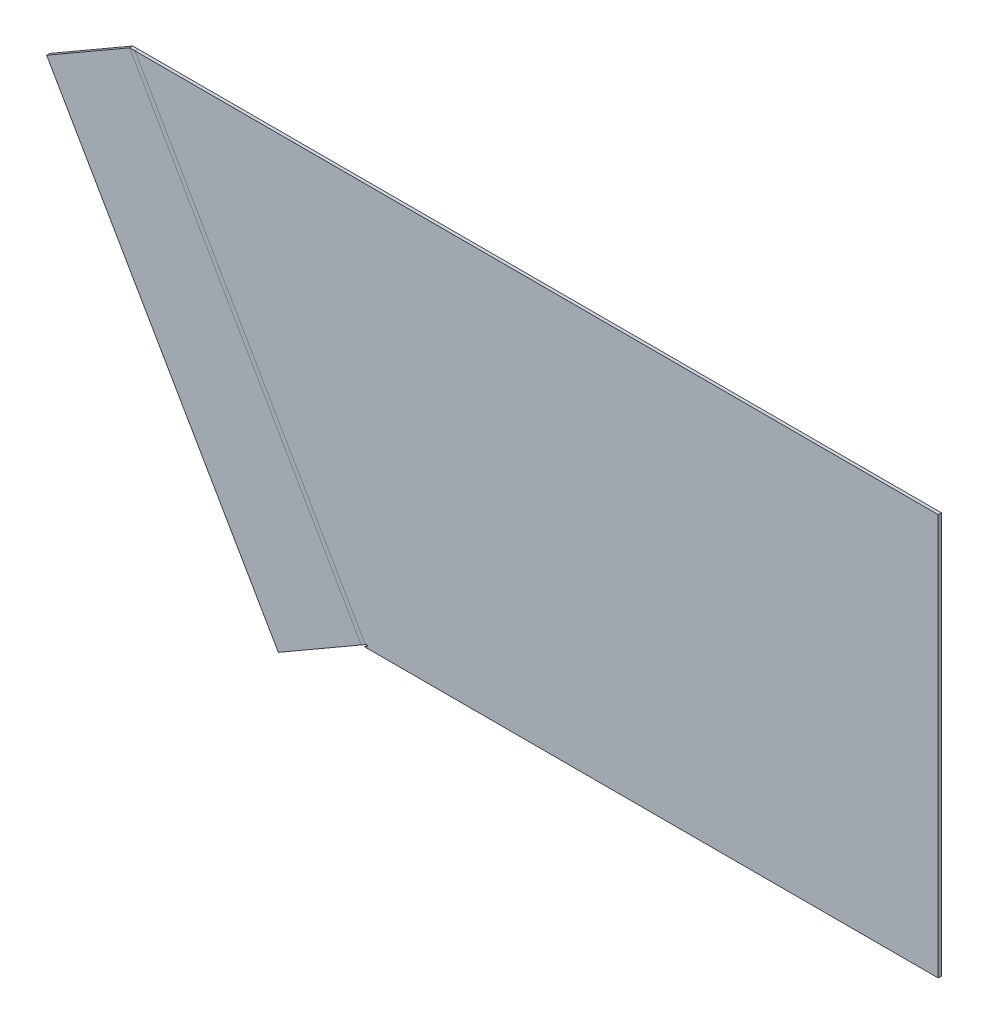
ISO-10303-21;
HEADER;
FILE_DESCRIPTION(('STEP AP214'),'2;1');
FILE_NAME('part.step','',(''),(''),'','','');
FILE_SCHEMA(('AUTOMOTIVE_DESIGN { 1 0 10303 214 1 1 1 1 }'));
ENDSEC;
DATA;
#1=APPLICATION_CONTEXT('core data for automotive mechanical design processes');
#2=APPLICATION_PROTOCOL_DEFINITION('international standard','automotive_design',2000,#1);
#3=PRODUCT_CONTEXT('',#1,'mechanical');
#4=PRODUCT('Part','Part','',(#3));
#5=PRODUCT_RELATED_PRODUCT_CATEGORY('part','',(#4));
#6=PRODUCT_DEFINITION_FORMATION('','',#4);
#7=PRODUCT_DEFINITION_CONTEXT('part definition',#1,'design');
#8=PRODUCT_DEFINITION('design','',#6,#7);
#9=PRODUCT_DEFINITION_SHAPE('','',#8);
#10=(LENGTH_UNIT() NAMED_UNIT(*) SI_UNIT(.MILLI.,.METRE.));
#11=(NAMED_UNIT(*) PLANE_ANGLE_UNIT() SI_UNIT($,.RADIAN.));
#12=(NAMED_UNIT(*) SI_UNIT($,.STERADIAN.) SOLID_ANGLE_UNIT());
#13=UNCERTAINTY_MEASURE_WITH_UNIT(LENGTH_MEASURE(1.E-05),#10,'distance_accuracy_value','');
#14=(GEOMETRIC_REPRESENTATION_CONTEXT(3) GLOBAL_UNCERTAINTY_ASSIGNED_CONTEXT((#13)) GLOBAL_UNIT_ASSIGNED_CONTEXT((#10,
#11,#12)) REPRESENTATION_CONTEXT('',''));
#15=CARTESIAN_POINT('',(0.,0.,0.));
#16=DIRECTION('',(0.,0.,1.));
#17=DIRECTION('',(1.,0.,0.));
#18=AXIS2_PLACEMENT_3D('',#15,#16,#17);
#19=CARTESIAN_POINT('',(-334.150442123171,-24.277834079355,-1.58749999999958));
#20=DIRECTION('',(-0.499999999999994,0.866025403784442,0.));
#21=DIRECTION('',(0.,0.,-1.));
#22=AXIS2_PLACEMENT_3D('',#19,#20,#21);
#23=PLANE('',#22);
#24=DIRECTION('',(0.,0.,-1.));
#25=VECTOR('',#24,1.);
#26=CARTESIAN_POINT('',(-292.169081251856,-0.0398840793552624,7.7715611723761E-13));
#27=LINE('',#26,#25);
#28=CARTESIAN_POINT('',(-292.169081251856,-0.0398840793552624,-7.44537734084289E-13));
#29=VERTEX_POINT('',#28);
#30=CARTESIAN_POINT('',(-292.169081251856,-0.0398840793552901,-1.5874999999993));
#31=VERTEX_POINT('',#30);
#32=EDGE_CURVE('E243',#29,#31,#27,.T.);
#33=ORIENTED_EDGE('',*,*,#32,.F.);
#34=DIRECTION('',(0.866025403784442,0.499999999999994,0.));
#35=VECTOR('',#34,1.);
#36=CARTESIAN_POINT('',(-334.150442123171,-24.277834079355,3.88578058618805E-13));
#37=LINE('',#36,#35);
#38=CARTESIAN_POINT('',(-334.150442123171,-24.277834079355,4.44089209850063E-13));
#39=VERTEX_POINT('',#38);
#40=EDGE_CURVE('E259',#29,#39,#37,.F.);
#41=ORIENTED_EDGE('',*,*,#40,.T.);
#42=DIRECTION('',(0.,0.,1.));
#43=VECTOR('',#42,1.);
#44=CARTESIAN_POINT('',(-334.150442123171,-24.277834079355,-1.58749999999952));
#45=LINE('',#44,#43);
#46=CARTESIAN_POINT('',(-334.150442123171,-24.277834079355,-1.58749999999969));
#47=VERTEX_POINT('',#46);
#48=EDGE_CURVE('E248',#47,#39,#45,.T.);
#49=ORIENTED_EDGE('',*,*,#48,.F.);
#50=DIRECTION('',(-0.866025403784442,-0.499999999999994,0.));
#51=VECTOR('',#50,1.);
#52=CARTESIAN_POINT('',(-291.531166939428,0.328415920645059,-1.5874999999993));
#53=LINE('',#52,#51);
#54=EDGE_CURVE('E87',#31,#47,#53,.T.);
#55=ORIENTED_EDGE('',*,*,#54,.F.);
#56=EDGE_LOOP('',(#33,#41,#49,#55));
#57=FACE_BOUND('',#56,.T.);
#58=ADVANCED_FACE('F65',(#57),#23,.F.);
#59=CARTESIAN_POINT('',(-408.848741638759,203.528415920645,-1.58750000000057));
#60=DIRECTION('',(0.499999999999993,-0.866025403784443,0.));
#61=DIRECTION('',(0.,0.,1.));
#62=AXIS2_PLACEMENT_3D('',#59,#60,#61);
#63=PLANE('',#62);
#64=CARTESIAN_POINT('',(-409.486655951187,203.160115920645,-1.58750000000074));
#65=CARTESIAN_POINT('',(-409.486655951187,203.160115920645,-7.37367233194078E-13));
#66=B_SPLINE_CURVE_WITH_KNOTS('',1,(#64,#65),.UNSPECIFIED.,.F.,.F.,(2,2),(0.,1.),.UNSPECIFIED.);
#67=CARTESIAN_POINT('',(-409.486655951187,203.160115920645,-7.21644966006352E-13));
#68=VERTEX_POINT('',#67);
#69=CARTESIAN_POINT('',(-409.486655951187,203.160115920645,-1.58750000000074));
#70=VERTEX_POINT('',#69);
#71=EDGE_CURVE('E13',#68,#70,#66,.F.);
#72=ORIENTED_EDGE('',*,*,#71,.T.);
#73=DIRECTION('',(0.866025403784443,0.499999999999993,0.));
#74=VECTOR('',#73,1.);
#75=CARTESIAN_POINT('',(-408.848741638758,203.528415920646,-1.58750000000069));
#76=LINE('',#75,#74);
#77=CARTESIAN_POINT('',(-451.468016822501,178.922165920646,-1.58750000000107));
#78=VERTEX_POINT('',#77);
#79=EDGE_CURVE('E80',#78,#70,#76,.T.);
#80=ORIENTED_EDGE('',*,*,#79,.F.);
#81=DIRECTION('',(0.,0.,1.));
#82=VECTOR('',#81,1.);
#83=CARTESIAN_POINT('',(-451.468016822501,178.922165920646,-1.58750000000096));
#84=LINE('',#83,#82);
#85=CARTESIAN_POINT('',(-451.468016822501,178.922165920646,-1.0547118733939E-12));
#86=VERTEX_POINT('',#85);
#87=EDGE_CURVE('E245',#78,#86,#84,.T.);
#88=ORIENTED_EDGE('',*,*,#87,.T.);
#89=DIRECTION('',(-0.866025403784443,-0.499999999999993,0.));
#90=VECTOR('',#89,1.);
#91=CARTESIAN_POINT('',(-408.848741638759,203.528415920645,-7.21644966006352E-13));
#92=LINE('',#91,#90);
#93=EDGE_CURVE('E253',#86,#68,#92,.F.);
#94=ORIENTED_EDGE('',*,*,#93,.T.);
#95=EDGE_LOOP('',(#72,#80,#88,#94));
#96=FACE_BOUND('',#95,.T.);
#97=ADVANCED_FACE('F222',(#96),#63,.F.);
#98=CARTESIAN_POINT('',(-218.506166939429,-126.154594302072,-1.58749999999847));
#99=DIRECTION('',(0.,0.,1.));
#100=DIRECTION('',(-0.499999999999993,0.866025403784443,0.));
#101=AXIS2_PLACEMENT_3D('',#98,#99,#100);
#102=PLANE('',#101);
#103=DIRECTION('',(-0.499999999999993,0.866025403784443,0.));
#104=VECTOR('',#103,1.);
#105=CARTESIAN_POINT('',(-409.486655951187,203.160115920645,-1.58750000000069));
#106=LINE('',#105,#104);
#107=EDGE_CURVE('E73',#31,#70,#106,.T.);
#108=ORIENTED_EDGE('',*,*,#107,.F.);
#109=ORIENTED_EDGE('',*,*,#54,.T.);
#110=DIRECTION('',(-0.499999999999993,0.866025403784443,0.));
#111=VECTOR('',#110,1.);
#112=CARTESIAN_POINT('',(-261.125442123172,-150.760844302072,-1.58749999999874));
#113=LINE('',#112,#111);
#114=EDGE_CURVE('E246',#47,#78,#113,.T.);
#115=ORIENTED_EDGE('',*,*,#114,.T.);
#116=ORIENTED_EDGE('',*,*,#79,.T.);
#117=EDGE_LOOP('',(#108,#109,#115,#116));
#118=FACE_BOUND('',#117,.T.);
#119=ADVANCED_FACE('F218',(#118),#102,.F.);
#120=CARTESIAN_POINT('',(-218.506166939429,-126.154594302072,1.55431223447522E-12));
#121=DIRECTION('',(0.,0.,1.));
#122=DIRECTION('',(-0.499999999999993,0.866025403784443,0.));
#123=AXIS2_PLACEMENT_3D('',#120,#121,#122);
#124=PLANE('',#123);
#125=ORIENTED_EDGE('',*,*,#40,.F.);
#126=DIRECTION('',(0.499999999999993,-0.866025403784443,0.));
#127=VECTOR('',#126,1.);
#128=CARTESIAN_POINT('',(-409.486655951187,203.160115920645,-6.66133814775094E-13));
#129=LINE('',#128,#127);
#130=EDGE_CURVE('E167',#68,#29,#129,.T.);
#131=ORIENTED_EDGE('',*,*,#130,.F.);
#132=ORIENTED_EDGE('',*,*,#93,.F.);
#133=DIRECTION('',(0.499999999999993,-0.866025403784443,0.));
#134=VECTOR('',#133,1.);
#135=CARTESIAN_POINT('',(-451.468016822501,178.922165920646,-9.99200722162641E-13));
#136=LINE('',#135,#134);
#137=EDGE_CURVE('E257',#39,#86,#136,.F.);
#138=ORIENTED_EDGE('',*,*,#137,.F.);
#139=EDGE_LOOP('',(#125,#131,#132,#138));
#140=FACE_BOUND('',#139,.T.);
#141=ADVANCED_FACE('F221',(#140),#124,.T.);
#142=CARTESIAN_POINT('',(-451.468016822501,178.922165920646,-1.58750000000091));
#143=DIRECTION('',(0.866025403784443,0.499999999999993,0.));
#144=DIRECTION('',(-0.249999999999988,0.433012701892219,-0.866025403784443));
#145=AXIS2_PLACEMENT_3D('',#142,#143,#144);
#146=PLANE('',#145);
#147=ORIENTED_EDGE('',*,*,#137,.T.);
#148=ORIENTED_EDGE('',*,*,#87,.F.);
#149=ORIENTED_EDGE('',*,*,#114,.F.);
#150=ORIENTED_EDGE('',*,*,#48,.T.);
#151=EDGE_LOOP('',(#147,#148,#149,#150));
#152=FACE_BOUND('',#151,.T.);
#153=ADVANCED_FACE('F225',(#152),#146,.F.);
#154=CARTESIAN_POINT('',(0.,203.2,-1.5875));
#155=DIRECTION('',(1.,0.,0.));
#156=DIRECTION('',(0.,0.,-1.));
#157=AXIS2_PLACEMENT_3D('',#154,#155,#156);
#158=PLANE('',#157);
#159=DIRECTION('',(0.,0.,1.));
#160=VECTOR('',#159,1.);
#161=CARTESIAN_POINT('',(0.,0.,-1.5875));
#162=LINE('',#161,#160);
#163=CARTESIAN_POINT('',(0.,0.,-1.5875));
#164=VERTEX_POINT('',#163);
#165=CARTESIAN_POINT('',(0.,0.,0.));
#166=VERTEX_POINT('',#165);
#167=EDGE_CURVE('E355',#164,#166,#162,.T.);
#168=ORIENTED_EDGE('',*,*,#167,.F.);
#169=DIRECTION('',(0.,-1.,0.));
#170=VECTOR('',#169,1.);
#171=CARTESIAN_POINT('',(0.,203.2,-1.5875));
#172=LINE('',#171,#170);
#173=CARTESIAN_POINT('',(0.,203.2,-1.5875));
#174=VERTEX_POINT('',#173);
#175=EDGE_CURVE('E340',#174,#164,#172,.T.);
#176=ORIENTED_EDGE('',*,*,#175,.F.);
#177=DIRECTION('',(0.,0.,1.));
#178=VECTOR('',#177,1.);
#179=CARTESIAN_POINT('',(0.,203.2,-1.5875));
#180=LINE('',#179,#178);
#181=CARTESIAN_POINT('',(0.,203.2,0.));
#182=VERTEX_POINT('',#181);
#183=EDGE_CURVE('E186',#174,#182,#180,.T.);
#184=ORIENTED_EDGE('',*,*,#183,.T.);
#185=DIRECTION('',(0.,-1.,0.));
#186=VECTOR('',#185,1.);
#187=CARTESIAN_POINT('',(0.,203.2,0.));
#188=LINE('',#187,#186);
#189=EDGE_CURVE('E363',#182,#166,#188,.T.);
#190=ORIENTED_EDGE('',*,*,#189,.T.);
#191=EDGE_LOOP('',(#168,#176,#184,#190));
#192=FACE_BOUND('',#191,.T.);
#193=ADVANCED_FACE('F369',(#192),#158,.T.);
#194=CARTESIAN_POINT('',(0.,0.,0.));
#195=DIRECTION('',(0.,-1.,0.));
#196=DIRECTION('',(-1.,0.,0.));
#197=AXIS2_PLACEMENT_3D('',#194,#195,#196);
#198=PLANE('',#197);
#199=DIRECTION('',(-1.,0.,0.));
#200=VECTOR('',#199,1.);
#201=CARTESIAN_POINT('',(0.,0.,0.));
#202=LINE('',#201,#200);
#203=CARTESIAN_POINT('',(-290.5125,0.,-3.54574179440962E-13));
#204=VERTEX_POINT('',#203);
#205=EDGE_CURVE('E361',#166,#204,#202,.T.);
#206=ORIENTED_EDGE('',*,*,#205,.T.);
#207=DIRECTION('',(0.,0.,-1.));
#208=VECTOR('',#207,1.);
#209=CARTESIAN_POINT('',(-290.5125,0.,-3.54574179440962E-13));
#210=LINE('',#209,#208);
#211=CARTESIAN_POINT('',(-290.5125,0.,-1.58749999999996));
#212=VERTEX_POINT('',#211);
#213=EDGE_CURVE('E358',#204,#212,#210,.T.);
#214=ORIENTED_EDGE('',*,*,#213,.T.);
#215=DIRECTION('',(-1.,0.,0.));
#216=VECTOR('',#215,1.);
#217=CARTESIAN_POINT('',(0.,0.,-1.5875));
#218=LINE('',#217,#216);
#219=EDGE_CURVE('E332',#164,#212,#218,.T.);
#220=ORIENTED_EDGE('',*,*,#219,.F.);
#221=ORIENTED_EDGE('',*,*,#167,.T.);
#222=EDGE_LOOP('',(#206,#214,#220,#221));
#223=FACE_BOUND('',#222,.T.);
#224=ADVANCED_FACE('F409',(#223),#198,.T.);
#225=CARTESIAN_POINT('',(-290.5125,0.,-3.54574179440962E-13));
#226=DIRECTION('',(-0.500000000000035,0.866025403784418,0.));
#227=DIRECTION('',(-0.866025403784418,-0.500000000000035,0.));
#228=AXIS2_PLACEMENT_3D('',#225,#226,#227);
#229=PLANE('',#228);
#230=DIRECTION('',(0.,0.,-1.));
#231=VECTOR('',#230,1.);
#232=CARTESIAN_POINT('',(-289.002987694811,0.871517335746138,-7.44725879205654E-13));
#233=LINE('',#232,#231);
#234=CARTESIAN_POINT('',(-289.002987694811,0.871517335746138,-7.44725879205654E-13));
#235=VERTEX_POINT('',#234);
#236=CARTESIAN_POINT('',(-289.002987694811,0.871517335746149,-1.58749999999996));
#237=VERTEX_POINT('',#236);
#238=EDGE_CURVE('E352',#235,#237,#233,.T.);
#239=ORIENTED_EDGE('',*,*,#238,.T.);
#240=DIRECTION('',(-0.866025403784418,-0.500000000000035,0.));
#241=VECTOR('',#240,1.);
#242=CARTESIAN_POINT('',(15.3600560244928,176.595602558476,-1.5875));
#243=LINE('',#242,#241);
#244=EDGE_CURVE('E350',#237,#212,#243,.T.);
#245=ORIENTED_EDGE('',*,*,#244,.T.);
#246=ORIENTED_EDGE('',*,*,#213,.F.);
#247=DIRECTION('',(0.866025403784418,0.500000000000035,-2.23834732691071E-13));
#248=VECTOR('',#247,1.);
#249=CARTESIAN_POINT('',(-290.5125,0.,-3.54574179440962E-13));
#250=LINE('',#249,#248);
#251=EDGE_CURVE('E347',#204,#235,#250,.T.);
#252=ORIENTED_EDGE('',*,*,#251,.T.);
#253=EDGE_LOOP('',(#239,#245,#246,#252));
#254=FACE_BOUND('',#253,.T.);
#255=ADVANCED_FACE('F415',(#254),#229,.T.);
#256=CARTESIAN_POINT('',(-289.002987694811,0.871517335746138,-7.44725879205654E-13));
#257=DIRECTION('',(-0.866025403784429,-0.500000000000017,0.));
#258=DIRECTION('',(0.500000000000017,-0.866025403784429,0.));
#259=AXIS2_PLACEMENT_3D('',#256,#257,#258);
#260=PLANE('',#259);
#261=DIRECTION('',(0.,0.,-1.));
#262=VECTOR('',#261,1.);
#263=CARTESIAN_POINT('',(-289.399862694811,1.55892500000004,-7.44846892497542E-13));
#264=LINE('',#263,#262);
#265=CARTESIAN_POINT('',(-289.399862694811,1.55892500000004,-7.44846892497542E-13));
#266=VERTEX_POINT('',#265);
#267=CARTESIAN_POINT('',(-289.399862694811,1.55892500000005,-1.58749999999996));
#268=VERTEX_POINT('',#267);
#269=EDGE_CURVE('E174',#266,#268,#264,.T.);
#270=ORIENTED_EDGE('',*,*,#269,.T.);
#271=DIRECTION('',(0.500000000000017,-0.866025403784429,0.));
#272=VECTOR('',#271,1.);
#273=CARTESIAN_POINT('',(-304.363043719307,27.4759147772764,-1.58749999999996));
#274=LINE('',#273,#272);
#275=EDGE_CURVE('E344',#268,#237,#274,.T.);
#276=ORIENTED_EDGE('',*,*,#275,.T.);
#277=ORIENTED_EDGE('',*,*,#238,.F.);
#278=DIRECTION('',(-0.500000000000017,0.866025403784429,0.));
#279=VECTOR('',#278,1.);
#280=CARTESIAN_POINT('',(-289.002987694811,0.871517335746138,-7.44725879205654E-13));
#281=LINE('',#280,#279);
#282=EDGE_CURVE('E193',#235,#266,#281,.T.);
#283=ORIENTED_EDGE('',*,*,#282,.T.);
#284=EDGE_LOOP('',(#270,#276,#277,#283));
#285=FACE_BOUND('',#284,.T.);
#286=ADVANCED_FACE('F423',(#285),#260,.T.);
#287=CARTESIAN_POINT('',(0.,203.2,0.));
#288=DIRECTION('',(0.,0.,1.));
#289=DIRECTION('',(1.,0.,0.));
#290=AXIS2_PLACEMENT_3D('',#287,#288,#289);
#291=PLANE('',#290);
#292=ORIENTED_EDGE('',*,*,#282,.F.);
#293=ORIENTED_EDGE('',*,*,#251,.F.);
#294=ORIENTED_EDGE('',*,*,#205,.F.);
#295=ORIENTED_EDGE('',*,*,#189,.F.);
#296=DIRECTION('',(-1.,0.,0.));
#297=VECTOR('',#296,1.);
#298=CARTESIAN_POINT('',(0.,203.2,0.));
#299=LINE('',#298,#297);
#300=CARTESIAN_POINT('',(-406.733935178083,203.200000000001,-7.44792682388917E-13));
#301=VERTEX_POINT('',#300);
#302=EDGE_CURVE('E158',#182,#301,#299,.T.);
#303=ORIENTED_EDGE('',*,*,#302,.T.);
#304=DIRECTION('',(-0.499999999999993,0.866025403784442,0.));
#305=VECTOR('',#304,1.);
#306=CARTESIAN_POINT('',(-290.087270359065,1.16205000000006,-7.44846892497542E-13));
#307=LINE('',#306,#305);
#308=CARTESIAN_POINT('',(-290.087270359065,1.16204999999994,-7.44792682388917E-13));
#309=VERTEX_POINT('',#308);
#310=EDGE_CURVE('E165',#309,#301,#307,.T.);
#311=ORIENTED_EDGE('',*,*,#310,.F.);
#312=DIRECTION('',(-0.866025403784441,-0.499999999999996,0.));
#313=VECTOR('',#312,1.);
#314=CARTESIAN_POINT('',(-289.399862694811,1.55892500000004,-7.44846892497542E-13));
#315=LINE('',#314,#313);
#316=EDGE_CURVE('E171',#266,#309,#315,.T.);
#317=ORIENTED_EDGE('',*,*,#316,.F.);
#318=EDGE_LOOP('',(#292,#293,#294,#295,#303,#311,#317));
#319=FACE_BOUND('',#318,.T.);
#320=ADVANCED_FACE('F181',(#319),#291,.T.);
#321=CARTESIAN_POINT('',(-289.399862694811,1.55892500000004,-7.44846892497542E-13));
#322=DIRECTION('',(0.499999999999996,-0.866025403784441,0.));
#323=DIRECTION('',(0.866025403784441,0.499999999999996,0.));
#324=AXIS2_PLACEMENT_3D('',#321,#322,#323);
#325=PLANE('',#324);
#326=DIRECTION('',(8.08857401698927E-13,4.66994038606888E-13,-1.));
#327=VECTOR('',#326,1.);
#328=CARTESIAN_POINT('',(-290.087270359065,1.16205000000004,-7.44846892497542E-13));
#329=LINE('',#328,#327);
#330=CARTESIAN_POINT('',(-290.087270359063,1.16205000000078,-1.58750000000075));
#331=VERTEX_POINT('',#330);
#332=EDGE_CURVE('E147',#309,#331,#329,.T.);
#333=ORIENTED_EDGE('',*,*,#332,.T.);
#334=DIRECTION('',(0.866025403784441,0.499999999999996,0.));
#335=VECTOR('',#334,1.);
#336=CARTESIAN_POINT('',(14.9631810244996,177.283010222716,-1.5875));
#337=LINE('',#336,#335);
#338=EDGE_CURVE('E157',#331,#268,#337,.T.);
#339=ORIENTED_EDGE('',*,*,#338,.T.);
#340=ORIENTED_EDGE('',*,*,#269,.F.);
#341=ORIENTED_EDGE('',*,*,#316,.T.);
#342=EDGE_LOOP('',(#333,#339,#340,#341));
#343=FACE_BOUND('',#342,.T.);
#344=ADVANCED_FACE('F172',(#343),#325,.T.);
#345=CARTESIAN_POINT('',(0.,203.2,-1.5875));
#346=DIRECTION('',(0.,0.,1.));
#347=DIRECTION('',(1.,0.,0.));
#348=AXIS2_PLACEMENT_3D('',#345,#346,#347);
#349=PLANE('',#348);
#350=ORIENTED_EDGE('',*,*,#244,.F.);
#351=ORIENTED_EDGE('',*,*,#275,.F.);
#352=ORIENTED_EDGE('',*,*,#338,.F.);
#353=DIRECTION('',(-0.499999999999993,0.866025403784442,0.));
#354=VECTOR('',#353,1.);
#355=CARTESIAN_POINT('',(-290.087270359063,1.16205000000082,-1.58750000000075));
#356=LINE('',#355,#354);
#357=CARTESIAN_POINT('',(-406.733935178083,203.200000000001,-1.58750000000074));
#358=VERTEX_POINT('',#357);
#359=EDGE_CURVE('E178',#331,#358,#356,.T.);
#360=ORIENTED_EDGE('',*,*,#359,.T.);
#361=DIRECTION('',(-1.,0.,0.));
#362=VECTOR('',#361,1.);
#363=CARTESIAN_POINT('',(0.,203.2,-1.5875));
#364=LINE('',#363,#362);
#365=EDGE_CURVE('E203',#174,#358,#364,.T.);
#366=ORIENTED_EDGE('',*,*,#365,.F.);
#367=ORIENTED_EDGE('',*,*,#175,.T.);
#368=ORIENTED_EDGE('',*,*,#219,.T.);
#369=EDGE_LOOP('',(#350,#351,#352,#360,#366,#367,#368));
#370=FACE_BOUND('',#369,.T.);
#371=ADVANCED_FACE('F216',(#370),#349,.F.);
#372=CARTESIAN_POINT('',(0.,203.2,0.));
#373=DIRECTION('',(0.,-1.,0.));
#374=DIRECTION('',(-1.,0.,0.));
#375=AXIS2_PLACEMENT_3D('',#372,#373,#374);
#376=PLANE('',#375);
#377=CARTESIAN_POINT('',(-406.733935178083,203.200000000001,-7.3770434426245E-13));
#378=CARTESIAN_POINT('',(-406.733935178083,203.200000000001,-1.58750000000074));
#379=B_SPLINE_CURVE_WITH_KNOTS('',1,(#377,#378),.UNSPECIFIED.,.F.,.F.,(2,2),(0.,1.),.UNSPECIFIED.);
#380=EDGE_CURVE('E184',#301,#358,#379,.T.);
#381=ORIENTED_EDGE('',*,*,#380,.F.);
#382=ORIENTED_EDGE('',*,*,#302,.F.);
#383=ORIENTED_EDGE('',*,*,#183,.F.);
#384=ORIENTED_EDGE('',*,*,#365,.T.);
#385=EDGE_LOOP('',(#381,#382,#383,#384));
#386=FACE_BOUND('',#385,.T.);
#387=ADVANCED_FACE('F205',(#386),#376,.F.);
#388=CARTESIAN_POINT('',(-406.733935178083,203.200000000001,-7.3770434426245E-13));
#389=CARTESIAN_POINT('',(-407.651508769118,203.186705306882,-7.37591973906326E-13));
#390=CARTESIAN_POINT('',(-408.569082360152,203.173410613764,-7.37479603550202E-13));
#391=CARTESIAN_POINT('',(-409.486655951187,203.160115920645,-7.37367233194078E-13));
#392=CARTESIAN_POINT('',(-406.733935178083,203.200000000001,-1.58750000000074));
#393=CARTESIAN_POINT('',(-407.651508769118,203.186705306882,-1.58750000000074));
#394=CARTESIAN_POINT('',(-408.569082360152,203.173410613764,-1.58750000000074));
#395=CARTESIAN_POINT('',(-409.486655951187,203.160115920645,-1.58750000000074));
#396=B_SPLINE_SURFACE_WITH_KNOTS('',1,3,((#388,#389,#390,#391),(#392,#393,#394,#395)),
.UNSPECIFIED.,.F.,.F.,.F.,(2,2),(4,4),(0.,1.),(0.,1.),.UNSPECIFIED.);
#397=CARTESIAN_POINT('',(-406.733935178083,203.200000000001,-1.58750000000074));
#398=CARTESIAN_POINT('',(-407.651508769118,203.186705306882,-1.58750000000074));
#399=CARTESIAN_POINT('',(-408.569082360152,203.173410613764,-1.58750000000074));
#400=CARTESIAN_POINT('',(-409.486655951187,203.160115920645,-1.58750000000074));
#401=B_SPLINE_CURVE_WITH_KNOTS('',3,(#397,#398,#399,#400),.UNSPECIFIED.,.F.,.F.,(4,4),(0.,1.),.UNSPECIFIED.);
#402=EDGE_CURVE('E275',#358,#70,#401,.T.);
#403=CARTESIAN_POINT('',(-409.486655951187,203.160115920645,-7.37367233194078E-13));
#404=CARTESIAN_POINT('',(-408.569082360152,203.173410613764,-7.37479603550202E-13));
#405=CARTESIAN_POINT('',(-407.651508769118,203.186705306882,-7.37591973906326E-13));
#406=CARTESIAN_POINT('',(-406.733935178083,203.200000000001,-7.3770434426245E-13));
#407=B_SPLINE_CURVE_WITH_KNOTS('',3,(#403,#404,#405,#406),.UNSPECIFIED.,.F.,.F.,(4,4),(0.,1.),.UNSPECIFIED.);
#408=EDGE_CURVE('E168',#301,#68,#407,.F.);
#409=ORIENTED_EDGE('',*,*,#380,.T.);
#410=ORIENTED_EDGE('',*,*,#402,.T.);
#411=ORIENTED_EDGE('',*,*,#71,.F.);
#412=ORIENTED_EDGE('',*,*,#408,.F.);
#413=EDGE_LOOP('',(#409,#410,#411,#412));
#414=FACE_BOUND('',#413,.T.);
#415=ADVANCED_FACE('F215',(#414),#396,.T.);
#416=CARTESIAN_POINT('',(-292.169081251856,-0.0398840793552901,-7.44537734084289E-13));
#417=DIRECTION('',(0.499999999999977,-0.866025403784452,0.));
#418=DIRECTION('',(0.866025403784452,0.499999999999977,0.));
#419=AXIS2_PLACEMENT_3D('',#416,#417,#418);
#420=PLANE('',#419);
#421=DIRECTION('',(0.866025403784452,0.499999999999977,0.));
#422=VECTOR('',#421,1.);
#423=CARTESIAN_POINT('',(-292.169081251856,-0.0398840793552901,-1.58750000000074));
#424=LINE('',#423,#422);
#425=EDGE_CURVE('E153',#31,#331,#424,.T.);
#426=ORIENTED_EDGE('',*,*,#425,.T.);
#427=ORIENTED_EDGE('',*,*,#332,.F.);
#428=DIRECTION('',(0.866025403784452,0.499999999999977,0.));
#429=VECTOR('',#428,1.);
#430=CARTESIAN_POINT('',(-292.169081251856,-0.0398840793552901,-7.44537734084289E-13));
#431=LINE('',#430,#429);
#432=EDGE_CURVE('E151',#29,#309,#431,.T.);
#433=ORIENTED_EDGE('',*,*,#432,.F.);
#434=ORIENTED_EDGE('',*,*,#32,.T.);
#435=EDGE_LOOP('',(#426,#427,#433,#434));
#436=FACE_BOUND('',#435,.T.);
#437=ADVANCED_FACE('F149',(#436),#420,.T.);
#438=CARTESIAN_POINT('',(-349.45150821497,101.580057960323,-7.44719418345227E-13));
#439=DIRECTION('',(0.,0.,1.));
#440=DIRECTION('',(1.,0.,0.));
#441=AXIS2_PLACEMENT_3D('',#438,#439,#440);
#442=PLANE('',#441);
#443=ORIENTED_EDGE('',*,*,#130,.T.);
#444=ORIENTED_EDGE('',*,*,#432,.T.);
#445=ORIENTED_EDGE('',*,*,#310,.T.);
#446=ORIENTED_EDGE('',*,*,#408,.T.);
#447=EDGE_LOOP('',(#443,#444,#445,#446));
#448=FACE_BOUND('',#447,.T.);
#449=ADVANCED_FACE('F162',(#448),#442,.T.);
#450=CARTESIAN_POINT('',(-349.45150821497,101.580057960323,-1.58750000000074));
#451=DIRECTION('',(0.,0.,1.));
#452=DIRECTION('',(1.,0.,0.));
#453=AXIS2_PLACEMENT_3D('',#450,#451,#452);
#454=PLANE('',#453);
#455=ORIENTED_EDGE('',*,*,#107,.T.);
#456=ORIENTED_EDGE('',*,*,#402,.F.);
#457=ORIENTED_EDGE('',*,*,#359,.F.);
#458=ORIENTED_EDGE('',*,*,#425,.F.);
#459=EDGE_LOOP('',(#455,#456,#457,#458));
#460=FACE_BOUND('',#459,.T.);
#461=ADVANCED_FACE('F292',(#460),#454,.F.);
#462=CLOSED_SHELL('',(#58,#97,#119,#141,#153,#193,#224,#255,#286,#320,#344,#371,#387,#415,#437,
#449,#461));
#463=MANIFOLD_SOLID_BREP('B2',#462);
#464=ADVANCED_BREP_SHAPE_REPRESENTATION('',(#18,#463),#14);
#465=SHAPE_DEFINITION_REPRESENTATION(#9,#464);
ENDSEC;
END-ISO-10303-21;
